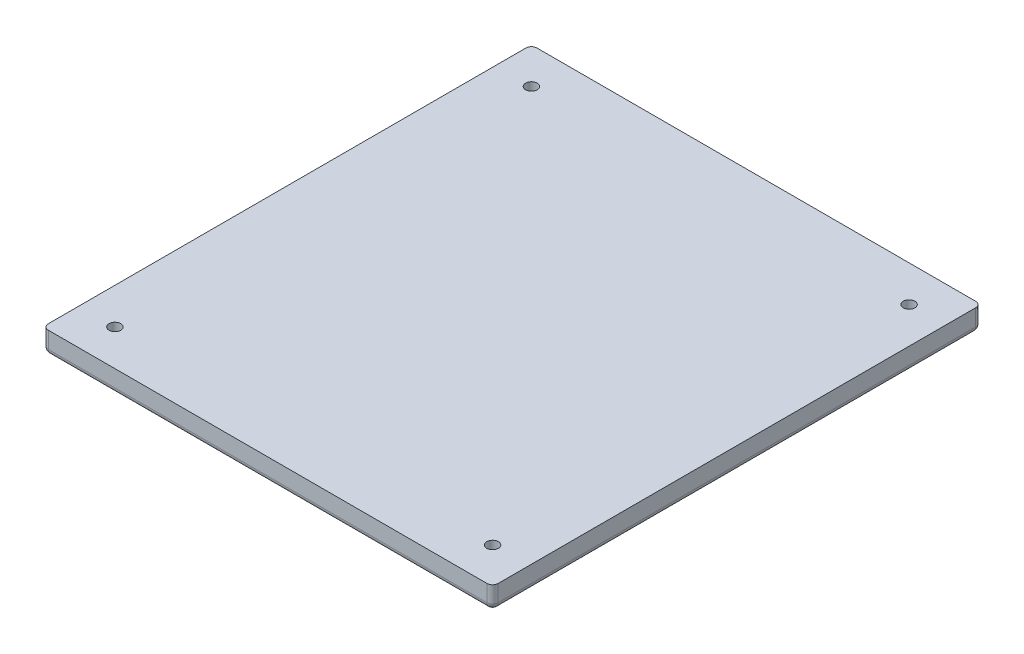
ISO-10303-21;
HEADER;
FILE_DESCRIPTION(('STEP AP214'),'2;1');
FILE_NAME('part.step','',(''),(''),'','','');
FILE_SCHEMA(('AUTOMOTIVE_DESIGN { 1 0 10303 214 1 1 1 1 }'));
ENDSEC;
DATA;
#1=APPLICATION_CONTEXT('core data for automotive mechanical design processes');
#2=APPLICATION_PROTOCOL_DEFINITION('international standard','automotive_design',2000,#1);
#3=PRODUCT_CONTEXT('',#1,'mechanical');
#4=PRODUCT('Part','Part','',(#3));
#5=PRODUCT_RELATED_PRODUCT_CATEGORY('part','',(#4));
#6=PRODUCT_DEFINITION_FORMATION('','',#4);
#7=PRODUCT_DEFINITION_CONTEXT('part definition',#1,'design');
#8=PRODUCT_DEFINITION('design','',#6,#7);
#9=PRODUCT_DEFINITION_SHAPE('','',#8);
#10=(LENGTH_UNIT() NAMED_UNIT(*) SI_UNIT(.MILLI.,.METRE.));
#11=(NAMED_UNIT(*) PLANE_ANGLE_UNIT() SI_UNIT($,.RADIAN.));
#12=(NAMED_UNIT(*) SI_UNIT($,.STERADIAN.) SOLID_ANGLE_UNIT());
#13=UNCERTAINTY_MEASURE_WITH_UNIT(LENGTH_MEASURE(1.E-05),#10,'distance_accuracy_value','');
#14=(GEOMETRIC_REPRESENTATION_CONTEXT(3) GLOBAL_UNCERTAINTY_ASSIGNED_CONTEXT((#13)) GLOBAL_UNIT_ASSIGNED_CONTEXT((#10,
#11,#12)) REPRESENTATION_CONTEXT('',''));
#15=CARTESIAN_POINT('',(0.,0.,0.));
#16=DIRECTION('',(0.,0.,1.));
#17=DIRECTION('',(1.,0.,0.));
#18=AXIS2_PLACEMENT_3D('',#15,#16,#17);
#19=CARTESIAN_POINT('',(0.,4.,0.));
#20=DIRECTION('',(1.,0.,0.));
#21=DIRECTION('',(0.,0.,-1.));
#22=AXIS2_PLACEMENT_3D('',#19,#20,#21);
#23=PLANE('',#22);
#24=DIRECTION('',(0.,0.,1.));
#25=VECTOR('',#24,1.);
#26=CARTESIAN_POINT('',(0.,1.,0.));
#27=LINE('',#26,#25);
#28=CARTESIAN_POINT('',(0.,1.,-87.));
#29=VERTEX_POINT('',#28);
#30=CARTESIAN_POINT('',(0.,1.,-1.));
#31=VERTEX_POINT('',#30);
#32=EDGE_CURVE('E188',#29,#31,#27,.T.);
#33=ORIENTED_EDGE('',*,*,#32,.T.);
#34=DIRECTION('',(0.,-1.,0.));
#35=VECTOR('',#34,1.);
#36=CARTESIAN_POINT('',(0.,4.,-1.));
#37=LINE('',#36,#35);
#38=CARTESIAN_POINT('',(0.,4.,-1.));
#39=VERTEX_POINT('',#38);
#40=EDGE_CURVE('E191',#31,#39,#37,.F.);
#41=ORIENTED_EDGE('',*,*,#40,.T.);
#42=DIRECTION('',(0.,0.,1.));
#43=VECTOR('',#42,1.);
#44=CARTESIAN_POINT('',(0.,4.,0.));
#45=LINE('',#44,#43);
#46=CARTESIAN_POINT('',(0.,4.,-87.));
#47=VERTEX_POINT('',#46);
#48=EDGE_CURVE('E262',#47,#39,#45,.T.);
#49=ORIENTED_EDGE('',*,*,#48,.F.);
#50=DIRECTION('',(0.,-1.,0.));
#51=VECTOR('',#50,1.);
#52=CARTESIAN_POINT('',(0.,4.,-87.));
#53=LINE('',#52,#51);
#54=EDGE_CURVE('E185',#47,#29,#53,.T.);
#55=ORIENTED_EDGE('',*,*,#54,.T.);
#56=EDGE_LOOP('',(#33,#41,#49,#55));
#57=FACE_BOUND('',#56,.T.);
#58=ADVANCED_FACE('F44',(#57),#23,.F.);
#59=CARTESIAN_POINT('',(0.,4.,0.));
#60=DIRECTION('',(0.,0.,-1.));
#61=DIRECTION('',(-1.,0.,0.));
#62=AXIS2_PLACEMENT_3D('',#59,#60,#61);
#63=PLANE('',#62);
#64=DIRECTION('',(1.,0.,0.));
#65=VECTOR('',#64,1.);
#66=CARTESIAN_POINT('',(81.,1.,0.));
#67=LINE('',#66,#65);
#68=CARTESIAN_POINT('',(1.,1.,0.));
#69=VERTEX_POINT('',#68);
#70=CARTESIAN_POINT('',(80.,1.,0.));
#71=VERTEX_POINT('',#70);
#72=EDGE_CURVE('E154',#69,#71,#67,.T.);
#73=ORIENTED_EDGE('',*,*,#72,.T.);
#74=DIRECTION('',(0.,-1.,0.));
#75=VECTOR('',#74,1.);
#76=CARTESIAN_POINT('',(80.,4.,0.));
#77=LINE('',#76,#75);
#78=CARTESIAN_POINT('',(80.,4.,0.));
#79=VERTEX_POINT('',#78);
#80=EDGE_CURVE('E162',#71,#79,#77,.F.);
#81=ORIENTED_EDGE('',*,*,#80,.T.);
#82=DIRECTION('',(1.,0.,0.));
#83=VECTOR('',#82,1.);
#84=CARTESIAN_POINT('',(0.,4.,0.));
#85=LINE('',#84,#83);
#86=CARTESIAN_POINT('',(1.,4.,0.));
#87=VERTEX_POINT('',#86);
#88=EDGE_CURVE('E128',#87,#79,#85,.T.);
#89=ORIENTED_EDGE('',*,*,#88,.F.);
#90=DIRECTION('',(0.,-1.,0.));
#91=VECTOR('',#90,1.);
#92=CARTESIAN_POINT('',(1.,4.,0.));
#93=LINE('',#92,#91);
#94=EDGE_CURVE('E150',#87,#69,#93,.T.);
#95=ORIENTED_EDGE('',*,*,#94,.T.);
#96=EDGE_LOOP('',(#73,#81,#89,#95));
#97=FACE_BOUND('',#96,.T.);
#98=ADVANCED_FACE('F327',(#97),#63,.F.);
#99=CARTESIAN_POINT('',(81.,4.,0.));
#100=DIRECTION('',(-1.,0.,0.));
#101=DIRECTION('',(0.,0.,1.));
#102=AXIS2_PLACEMENT_3D('',#99,#100,#101);
#103=PLANE('',#102);
#104=DIRECTION('',(0.,0.,-1.));
#105=VECTOR('',#104,1.);
#106=CARTESIAN_POINT('',(81.,4.,0.));
#107=LINE('',#106,#105);
#108=CARTESIAN_POINT('',(81.,4.,-1.));
#109=VERTEX_POINT('',#108);
#110=CARTESIAN_POINT('',(81.,4.,-87.));
#111=VERTEX_POINT('',#110);
#112=EDGE_CURVE('E125',#109,#111,#107,.T.);
#113=ORIENTED_EDGE('',*,*,#112,.F.);
#114=DIRECTION('',(0.,-1.,0.));
#115=VECTOR('',#114,1.);
#116=CARTESIAN_POINT('',(81.,4.,-1.));
#117=LINE('',#116,#115);
#118=CARTESIAN_POINT('',(81.,1.,-1.));
#119=VERTEX_POINT('',#118);
#120=EDGE_CURVE('E139',#109,#119,#117,.T.);
#121=ORIENTED_EDGE('',*,*,#120,.T.);
#122=DIRECTION('',(0.,0.,-1.));
#123=VECTOR('',#122,1.);
#124=CARTESIAN_POINT('',(81.,1.,-88.));
#125=LINE('',#124,#123);
#126=CARTESIAN_POINT('',(81.,1.,-87.));
#127=VERTEX_POINT('',#126);
#128=EDGE_CURVE('E156',#119,#127,#125,.T.);
#129=ORIENTED_EDGE('',*,*,#128,.T.);
#130=DIRECTION('',(0.,-1.,0.));
#131=VECTOR('',#130,1.);
#132=CARTESIAN_POINT('',(81.,4.,-87.));
#133=LINE('',#132,#131);
#134=EDGE_CURVE('E141',#127,#111,#133,.F.);
#135=ORIENTED_EDGE('',*,*,#134,.T.);
#136=EDGE_LOOP('',(#113,#121,#129,#135));
#137=FACE_BOUND('',#136,.T.);
#138=ADVANCED_FACE('F138',(#137),#103,.F.);
#139=CARTESIAN_POINT('',(0.,4.,-88.));
#140=DIRECTION('',(0.,0.,1.));
#141=DIRECTION('',(1.,0.,0.));
#142=AXIS2_PLACEMENT_3D('',#139,#140,#141);
#143=PLANE('',#142);
#144=DIRECTION('',(-1.,0.,0.));
#145=VECTOR('',#144,1.);
#146=CARTESIAN_POINT('',(0.,1.,-88.));
#147=LINE('',#146,#145);
#148=CARTESIAN_POINT('',(80.,1.,-88.));
#149=VERTEX_POINT('',#148);
#150=CARTESIAN_POINT('',(1.,1.,-88.));
#151=VERTEX_POINT('',#150);
#152=EDGE_CURVE('E61',#149,#151,#147,.T.);
#153=ORIENTED_EDGE('',*,*,#152,.T.);
#154=DIRECTION('',(0.,-1.,0.));
#155=VECTOR('',#154,1.);
#156=CARTESIAN_POINT('',(1.,4.,-88.));
#157=LINE('',#156,#155);
#158=CARTESIAN_POINT('',(1.,4.,-88.));
#159=VERTEX_POINT('',#158);
#160=EDGE_CURVE('E11',#151,#159,#157,.F.);
#161=ORIENTED_EDGE('',*,*,#160,.T.);
#162=DIRECTION('',(-1.,0.,0.));
#163=VECTOR('',#162,1.);
#164=CARTESIAN_POINT('',(0.,4.,-88.));
#165=LINE('',#164,#163);
#166=CARTESIAN_POINT('',(80.,4.,-88.));
#167=VERTEX_POINT('',#166);
#168=EDGE_CURVE('E143',#167,#159,#165,.T.);
#169=ORIENTED_EDGE('',*,*,#168,.F.);
#170=DIRECTION('',(0.,-1.,0.));
#171=VECTOR('',#170,1.);
#172=CARTESIAN_POINT('',(80.,4.,-88.));
#173=LINE('',#172,#171);
#174=EDGE_CURVE('E54',#167,#149,#173,.T.);
#175=ORIENTED_EDGE('',*,*,#174,.T.);
#176=EDGE_LOOP('',(#153,#161,#169,#175));
#177=FACE_BOUND('',#176,.T.);
#178=ADVANCED_FACE('F363',(#177),#143,.F.);
#179=CARTESIAN_POINT('',(0.,4.,0.));
#180=DIRECTION('',(0.,-1.,0.));
#181=DIRECTION('',(0.,0.,-1.));
#182=AXIS2_PLACEMENT_3D('',#179,#180,#181);
#183=PLANE('',#182);
#184=CARTESIAN_POINT('',(6.5,4.,-6.50000000000001));
#185=DIRECTION('',(0.,1.,0.));
#186=DIRECTION('',(0.,0.,-1.));
#187=AXIS2_PLACEMENT_3D('',#184,#185,#186);
#188=CIRCLE('',#187,1.05);
#189=CARTESIAN_POINT('',(6.5,4.,-7.55));
#190=VERTEX_POINT('',#189);
#191=EDGE_CURVE('E241',#190,#190,#188,.T.);
#192=ORIENTED_EDGE('',*,*,#191,.F.);
#193=EDGE_LOOP('',(#192));
#194=FACE_BOUND('',#193,.T.);
#195=CARTESIAN_POINT('',(74.5,4.,-6.50000000000001));
#196=DIRECTION('',(0.,1.,0.));
#197=DIRECTION('',(0.,0.,1.));
#198=AXIS2_PLACEMENT_3D('',#195,#196,#197);
#199=CIRCLE('',#198,1.04999999999999);
#200=CARTESIAN_POINT('',(74.5,4.,-5.45000000000001));
#201=VERTEX_POINT('',#200);
#202=EDGE_CURVE('E247',#201,#201,#199,.T.);
#203=ORIENTED_EDGE('',*,*,#202,.F.);
#204=EDGE_LOOP('',(#203));
#205=FACE_BOUND('',#204,.T.);
#206=CARTESIAN_POINT('',(74.5,4.,-81.5));
#207=DIRECTION('',(0.,1.,0.));
#208=DIRECTION('',(0.,0.,-1.));
#209=AXIS2_PLACEMENT_3D('',#206,#207,#208);
#210=CIRCLE('',#209,1.04999999999999);
#211=CARTESIAN_POINT('',(74.5,4.,-82.55));
#212=VERTEX_POINT('',#211);
#213=EDGE_CURVE('E253',#212,#212,#210,.T.);
#214=ORIENTED_EDGE('',*,*,#213,.F.);
#215=EDGE_LOOP('',(#214));
#216=FACE_BOUND('',#215,.T.);
#217=CARTESIAN_POINT('',(6.5,4.,-81.5));
#218=DIRECTION('',(0.,1.,0.));
#219=DIRECTION('',(0.,0.,1.));
#220=AXIS2_PLACEMENT_3D('',#217,#218,#219);
#221=CIRCLE('',#220,1.05);
#222=CARTESIAN_POINT('',(6.5,4.,-80.45));
#223=VERTEX_POINT('',#222);
#224=EDGE_CURVE('E257',#223,#223,#221,.T.);
#225=ORIENTED_EDGE('',*,*,#224,.F.);
#226=EDGE_LOOP('',(#225));
#227=FACE_BOUND('',#226,.T.);
#228=ORIENTED_EDGE('',*,*,#88,.T.);
#229=CARTESIAN_POINT('',(80.,4.,-1.));
#230=DIRECTION('',(0.,-1.,0.));
#231=DIRECTION('',(0.,0.,-1.));
#232=AXIS2_PLACEMENT_3D('',#229,#230,#231);
#233=CIRCLE('',#232,1.);
#234=EDGE_CURVE('E122',#79,#109,#233,.F.);
#235=ORIENTED_EDGE('',*,*,#234,.T.);
#236=ORIENTED_EDGE('',*,*,#112,.T.);
#237=CARTESIAN_POINT('',(80.,4.,-87.));
#238=DIRECTION('',(0.,-1.,0.));
#239=DIRECTION('',(0.,0.,-1.));
#240=AXIS2_PLACEMENT_3D('',#237,#238,#239);
#241=CIRCLE('',#240,1.);
#242=EDGE_CURVE('E165',#111,#167,#241,.F.);
#243=ORIENTED_EDGE('',*,*,#242,.T.);
#244=ORIENTED_EDGE('',*,*,#168,.T.);
#245=CARTESIAN_POINT('',(1.,4.,-87.));
#246=DIRECTION('',(0.,-1.,0.));
#247=DIRECTION('',(0.,0.,-1.));
#248=AXIS2_PLACEMENT_3D('',#245,#246,#247);
#249=CIRCLE('',#248,1.);
#250=EDGE_CURVE('E168',#159,#47,#249,.F.);
#251=ORIENTED_EDGE('',*,*,#250,.T.);
#252=ORIENTED_EDGE('',*,*,#48,.T.);
#253=CARTESIAN_POINT('',(1.,4.,-1.));
#254=DIRECTION('',(0.,-1.,0.));
#255=DIRECTION('',(0.,0.,-1.));
#256=AXIS2_PLACEMENT_3D('',#253,#254,#255);
#257=CIRCLE('',#256,1.);
#258=EDGE_CURVE('E134',#39,#87,#257,.F.);
#259=ORIENTED_EDGE('',*,*,#258,.T.);
#260=EDGE_LOOP('',(#228,#235,#236,#243,#244,#251,#252,#259));
#261=FACE_BOUND('',#260,.T.);
#262=ADVANCED_FACE('F124',(#194,#205,#216,#227,#261),#183,.F.);
#263=CARTESIAN_POINT('',(0.,0.,0.));
#264=DIRECTION('',(0.,-1.,0.));
#265=DIRECTION('',(0.,0.,-1.));
#266=AXIS2_PLACEMENT_3D('',#263,#264,#265);
#267=PLANE('',#266);
#268=DIRECTION('',(0.,0.,-1.));
#269=VECTOR('',#268,1.);
#270=CARTESIAN_POINT('',(80.,0.,0.));
#271=LINE('',#270,#269);
#272=CARTESIAN_POINT('',(80.,0.,-87.));
#273=VERTEX_POINT('',#272);
#274=CARTESIAN_POINT('',(80.,0.,-1.));
#275=VERTEX_POINT('',#274);
#276=EDGE_CURVE('E133',#273,#275,#271,.F.);
#277=ORIENTED_EDGE('',*,*,#276,.T.);
#278=DIRECTION('',(1.,0.,0.));
#279=VECTOR('',#278,1.);
#280=CARTESIAN_POINT('',(0.,0.,-1.));
#281=LINE('',#280,#279);
#282=CARTESIAN_POINT('',(1.,0.,-1.));
#283=VERTEX_POINT('',#282);
#284=EDGE_CURVE('E181',#275,#283,#281,.F.);
#285=ORIENTED_EDGE('',*,*,#284,.T.);
#286=DIRECTION('',(0.,0.,1.));
#287=VECTOR('',#286,1.);
#288=CARTESIAN_POINT('',(1.,0.,-88.));
#289=LINE('',#288,#287);
#290=CARTESIAN_POINT('',(1.,0.,-87.));
#291=VERTEX_POINT('',#290);
#292=EDGE_CURVE('E178',#283,#291,#289,.F.);
#293=ORIENTED_EDGE('',*,*,#292,.T.);
#294=DIRECTION('',(-1.,0.,0.));
#295=VECTOR('',#294,1.);
#296=CARTESIAN_POINT('',(81.,0.,-87.));
#297=LINE('',#296,#295);
#298=EDGE_CURVE('E175',#291,#273,#297,.F.);
#299=ORIENTED_EDGE('',*,*,#298,.T.);
#300=EDGE_LOOP('',(#277,#285,#293,#299));
#301=FACE_BOUND('',#300,.T.);
#302=CARTESIAN_POINT('',(6.5,0.,-6.50000000000001));
#303=DIRECTION('',(0.,-1.,0.));
#304=DIRECTION('',(0.,0.,-1.));
#305=AXIS2_PLACEMENT_3D('',#302,#303,#304);
#306=CIRCLE('',#305,1.05);
#307=CARTESIAN_POINT('',(6.5,0.,-7.55));
#308=VERTEX_POINT('',#307);
#309=EDGE_CURVE('E266',#308,#308,#306,.T.);
#310=ORIENTED_EDGE('',*,*,#309,.F.);
#311=EDGE_LOOP('',(#310));
#312=FACE_BOUND('',#311,.T.);
#313=CARTESIAN_POINT('',(74.5,0.,-6.50000000000001));
#314=DIRECTION('',(0.,-1.,0.));
#315=DIRECTION('',(0.,0.,-1.));
#316=AXIS2_PLACEMENT_3D('',#313,#314,#315);
#317=CIRCLE('',#316,1.04999999999999);
#318=CARTESIAN_POINT('',(74.5,0.,-7.55));
#319=VERTEX_POINT('',#318);
#320=EDGE_CURVE('E279',#319,#319,#317,.T.);
#321=ORIENTED_EDGE('',*,*,#320,.F.);
#322=EDGE_LOOP('',(#321));
#323=FACE_BOUND('',#322,.T.);
#324=CARTESIAN_POINT('',(74.5,0.,-81.5));
#325=DIRECTION('',(0.,-1.,0.));
#326=DIRECTION('',(0.,0.,-1.));
#327=AXIS2_PLACEMENT_3D('',#324,#325,#326);
#328=CIRCLE('',#327,1.04999999999999);
#329=CARTESIAN_POINT('',(74.5,0.,-82.55));
#330=VERTEX_POINT('',#329);
#331=EDGE_CURVE('E275',#330,#330,#328,.T.);
#332=ORIENTED_EDGE('',*,*,#331,.F.);
#333=EDGE_LOOP('',(#332));
#334=FACE_BOUND('',#333,.T.);
#335=CARTESIAN_POINT('',(6.5,0.,-81.5));
#336=DIRECTION('',(0.,-1.,0.));
#337=DIRECTION('',(0.,0.,-1.));
#338=AXIS2_PLACEMENT_3D('',#335,#336,#337);
#339=CIRCLE('',#338,1.05);
#340=CARTESIAN_POINT('',(6.5,0.,-82.55));
#341=VERTEX_POINT('',#340);
#342=EDGE_CURVE('E261',#341,#341,#339,.T.);
#343=ORIENTED_EDGE('',*,*,#342,.F.);
#344=EDGE_LOOP('',(#343));
#345=FACE_BOUND('',#344,.T.);
#346=ADVANCED_FACE('F300',(#301,#312,#323,#334,#345),#267,.T.);
#347=CARTESIAN_POINT('',(6.5,-6.,-81.5));
#348=DIRECTION('',(0.,1.,0.));
#349=DIRECTION('',(0.,0.,1.));
#350=AXIS2_PLACEMENT_3D('',#347,#348,#349);
#351=CYLINDRICAL_SURFACE('',#350,1.05);
#352=ORIENTED_EDGE('',*,*,#342,.T.);
#353=EDGE_LOOP('',(#352));
#354=FACE_BOUND('',#353,.T.);
#355=ORIENTED_EDGE('',*,*,#224,.T.);
#356=EDGE_LOOP('',(#355));
#357=FACE_BOUND('',#356,.T.);
#358=ADVANCED_FACE('F374',(#354,#357),#351,.F.);
#359=CARTESIAN_POINT('',(74.5,-6.,-81.5));
#360=DIRECTION('',(0.,1.,0.));
#361=DIRECTION('',(0.,0.,1.));
#362=AXIS2_PLACEMENT_3D('',#359,#360,#361);
#363=CYLINDRICAL_SURFACE('',#362,1.04999999999999);
#364=ORIENTED_EDGE('',*,*,#331,.T.);
#365=EDGE_LOOP('',(#364));
#366=FACE_BOUND('',#365,.T.);
#367=ORIENTED_EDGE('',*,*,#213,.T.);
#368=EDGE_LOOP('',(#367));
#369=FACE_BOUND('',#368,.T.);
#370=ADVANCED_FACE('F378',(#366,#369),#363,.F.);
#371=CARTESIAN_POINT('',(74.5,-6.,-6.50000000000001));
#372=DIRECTION('',(0.,1.,0.));
#373=DIRECTION('',(0.,0.,1.));
#374=AXIS2_PLACEMENT_3D('',#371,#372,#373);
#375=CYLINDRICAL_SURFACE('',#374,1.04999999999999);
#376=ORIENTED_EDGE('',*,*,#320,.T.);
#377=EDGE_LOOP('',(#376));
#378=FACE_BOUND('',#377,.T.);
#379=ORIENTED_EDGE('',*,*,#202,.T.);
#380=EDGE_LOOP('',(#379));
#381=FACE_BOUND('',#380,.T.);
#382=ADVANCED_FACE('F382',(#378,#381),#375,.F.);
#383=CARTESIAN_POINT('',(6.5,-6.,-6.50000000000001));
#384=DIRECTION('',(0.,1.,0.));
#385=DIRECTION('',(0.,0.,1.));
#386=AXIS2_PLACEMENT_3D('',#383,#384,#385);
#387=CYLINDRICAL_SURFACE('',#386,1.05);
#388=ORIENTED_EDGE('',*,*,#309,.T.);
#389=EDGE_LOOP('',(#388));
#390=FACE_BOUND('',#389,.T.);
#391=ORIENTED_EDGE('',*,*,#191,.T.);
#392=EDGE_LOOP('',(#391));
#393=FACE_BOUND('',#392,.T.);
#394=ADVANCED_FACE('F380',(#390,#393),#387,.F.);
#395=CARTESIAN_POINT('',(1.,4.,-87.));
#396=DIRECTION('',(0.,-1.,0.));
#397=DIRECTION('',(0.,0.,-1.));
#398=AXIS2_PLACEMENT_3D('',#395,#396,#397);
#399=CYLINDRICAL_SURFACE('',#398,1.);
#400=CARTESIAN_POINT('',(1.,1.,-87.));
#401=DIRECTION('',(0.,-1.,0.));
#402=DIRECTION('',(0.,0.,-1.));
#403=AXIS2_PLACEMENT_3D('',#400,#401,#402);
#404=CIRCLE('',#403,1.);
#405=EDGE_CURVE('E48',#29,#151,#404,.T.);
#406=ORIENTED_EDGE('',*,*,#405,.F.);
#407=ORIENTED_EDGE('',*,*,#54,.F.);
#408=ORIENTED_EDGE('',*,*,#250,.F.);
#409=ORIENTED_EDGE('',*,*,#160,.F.);
#410=EDGE_LOOP('',(#406,#407,#408,#409));
#411=FACE_BOUND('',#410,.T.);
#412=ADVANCED_FACE('F46',(#411),#399,.T.);
#413=CARTESIAN_POINT('',(1.,1.,-87.));
#414=DIRECTION('',(0.,0.,-1.));
#415=DIRECTION('',(-1.,0.,0.));
#416=AXIS2_PLACEMENT_3D('',#413,#414,#415);
#417=SPHERICAL_SURFACE('',#416,1.);
#418=CARTESIAN_POINT('',(1.,1.,-87.));
#419=DIRECTION('',(0.,0.,-1.));
#420=DIRECTION('',(-1.,0.,0.));
#421=AXIS2_PLACEMENT_3D('',#418,#419,#420);
#422=CIRCLE('',#421,1.);
#423=EDGE_CURVE('E230',#29,#291,#422,.F.);
#424=ORIENTED_EDGE('',*,*,#423,.F.);
#425=ORIENTED_EDGE('',*,*,#405,.T.);
#426=CARTESIAN_POINT('',(1.,1.,-87.));
#427=DIRECTION('',(-1.,0.,0.));
#428=DIRECTION('',(0.,0.,1.));
#429=AXIS2_PLACEMENT_3D('',#426,#427,#428);
#430=CIRCLE('',#429,1.);
#431=EDGE_CURVE('E233',#291,#151,#430,.F.);
#432=ORIENTED_EDGE('',*,*,#431,.F.);
#433=EDGE_LOOP('',(#424,#425,#432));
#434=FACE_BOUND('',#433,.T.);
#435=ADVANCED_FACE('F315',(#434),#417,.T.);
#436=CARTESIAN_POINT('',(80.,4.,-87.));
#437=DIRECTION('',(0.,-1.,0.));
#438=DIRECTION('',(0.,0.,-1.));
#439=AXIS2_PLACEMENT_3D('',#436,#437,#438);
#440=CYLINDRICAL_SURFACE('',#439,1.);
#441=ORIENTED_EDGE('',*,*,#242,.F.);
#442=ORIENTED_EDGE('',*,*,#134,.F.);
#443=CARTESIAN_POINT('',(80.,1.,-87.));
#444=DIRECTION('',(0.,-1.,0.));
#445=DIRECTION('',(0.,0.,-1.));
#446=AXIS2_PLACEMENT_3D('',#443,#444,#445);
#447=CIRCLE('',#446,1.);
#448=EDGE_CURVE('E226',#149,#127,#447,.T.);
#449=ORIENTED_EDGE('',*,*,#448,.F.);
#450=ORIENTED_EDGE('',*,*,#174,.F.);
#451=EDGE_LOOP('',(#441,#442,#449,#450));
#452=FACE_BOUND('',#451,.T.);
#453=ADVANCED_FACE('F291',(#452),#440,.T.);
#454=CARTESIAN_POINT('',(0.,1.,-87.));
#455=DIRECTION('',(1.,0.,0.));
#456=DIRECTION('',(0.,0.,-1.));
#457=AXIS2_PLACEMENT_3D('',#454,#455,#456);
#458=CYLINDRICAL_SURFACE('',#457,1.);
#459=ORIENTED_EDGE('',*,*,#431,.T.);
#460=ORIENTED_EDGE('',*,*,#152,.F.);
#461=CARTESIAN_POINT('',(80.,1.,-87.));
#462=DIRECTION('',(1.,0.,0.));
#463=DIRECTION('',(0.,0.,-1.));
#464=AXIS2_PLACEMENT_3D('',#461,#462,#463);
#465=CIRCLE('',#464,1.);
#466=EDGE_CURVE('E222',#273,#149,#465,.T.);
#467=ORIENTED_EDGE('',*,*,#466,.F.);
#468=ORIENTED_EDGE('',*,*,#298,.F.);
#469=EDGE_LOOP('',(#459,#460,#467,#468));
#470=FACE_BOUND('',#469,.T.);
#471=ADVANCED_FACE('F316',(#470),#458,.T.);
#472=CARTESIAN_POINT('',(1.,1.,0.));
#473=DIRECTION('',(0.,0.,-1.));
#474=DIRECTION('',(-1.,0.,0.));
#475=AXIS2_PLACEMENT_3D('',#472,#473,#474);
#476=CYLINDRICAL_SURFACE('',#475,1.);
#477=ORIENTED_EDGE('',*,*,#423,.T.);
#478=ORIENTED_EDGE('',*,*,#292,.F.);
#479=CARTESIAN_POINT('',(1.,1.,-1.));
#480=DIRECTION('',(0.,0.,1.));
#481=DIRECTION('',(1.,0.,0.));
#482=AXIS2_PLACEMENT_3D('',#479,#480,#481);
#483=CIRCLE('',#482,1.);
#484=EDGE_CURVE('E218',#31,#283,#483,.T.);
#485=ORIENTED_EDGE('',*,*,#484,.F.);
#486=ORIENTED_EDGE('',*,*,#32,.F.);
#487=EDGE_LOOP('',(#477,#478,#485,#486));
#488=FACE_BOUND('',#487,.T.);
#489=ADVANCED_FACE('F314',(#488),#476,.T.);
#490=CARTESIAN_POINT('',(1.,4.,-1.));
#491=DIRECTION('',(0.,-1.,0.));
#492=DIRECTION('',(0.,0.,-1.));
#493=AXIS2_PLACEMENT_3D('',#490,#491,#492);
#494=CYLINDRICAL_SURFACE('',#493,1.);
#495=ORIENTED_EDGE('',*,*,#258,.F.);
#496=ORIENTED_EDGE('',*,*,#40,.F.);
#497=CARTESIAN_POINT('',(1.,1.,-1.));
#498=DIRECTION('',(0.,-1.,0.));
#499=DIRECTION('',(0.,0.,-1.));
#500=AXIS2_PLACEMENT_3D('',#497,#498,#499);
#501=CIRCLE('',#500,1.);
#502=EDGE_CURVE('E214',#69,#31,#501,.T.);
#503=ORIENTED_EDGE('',*,*,#502,.F.);
#504=ORIENTED_EDGE('',*,*,#94,.F.);
#505=EDGE_LOOP('',(#495,#496,#503,#504));
#506=FACE_BOUND('',#505,.T.);
#507=ADVANCED_FACE('F323',(#506),#494,.T.);
#508=CARTESIAN_POINT('',(80.,1.,-87.));
#509=DIRECTION('',(0.,0.,-1.));
#510=DIRECTION('',(-1.,0.,0.));
#511=AXIS2_PLACEMENT_3D('',#508,#509,#510);
#512=SPHERICAL_SURFACE('',#511,1.);
#513=ORIENTED_EDGE('',*,*,#466,.T.);
#514=ORIENTED_EDGE('',*,*,#448,.T.);
#515=CARTESIAN_POINT('',(80.,1.,-87.));
#516=DIRECTION('',(0.,0.,-1.));
#517=DIRECTION('',(-1.,0.,0.));
#518=AXIS2_PLACEMENT_3D('',#515,#516,#517);
#519=CIRCLE('',#518,1.);
#520=EDGE_CURVE('E210',#273,#127,#519,.F.);
#521=ORIENTED_EDGE('',*,*,#520,.F.);
#522=EDGE_LOOP('',(#513,#514,#521));
#523=FACE_BOUND('',#522,.T.);
#524=ADVANCED_FACE('F294',(#523),#512,.T.);
#525=CARTESIAN_POINT('',(1.,1.,-1.));
#526=DIRECTION('',(-1.,0.,0.));
#527=DIRECTION('',(0.,0.,1.));
#528=AXIS2_PLACEMENT_3D('',#525,#526,#527);
#529=SPHERICAL_SURFACE('',#528,1.);
#530=ORIENTED_EDGE('',*,*,#502,.T.);
#531=ORIENTED_EDGE('',*,*,#484,.T.);
#532=CARTESIAN_POINT('',(1.,1.,-1.));
#533=DIRECTION('',(-1.,0.,0.));
#534=DIRECTION('',(0.,0.,1.));
#535=AXIS2_PLACEMENT_3D('',#532,#533,#534);
#536=CIRCLE('',#535,1.);
#537=EDGE_CURVE('E207',#69,#283,#536,.F.);
#538=ORIENTED_EDGE('',*,*,#537,.F.);
#539=EDGE_LOOP('',(#530,#531,#538));
#540=FACE_BOUND('',#539,.T.);
#541=ADVANCED_FACE('F310',(#540),#529,.T.);
#542=CARTESIAN_POINT('',(80.,1.,0.));
#543=DIRECTION('',(0.,0.,1.));
#544=DIRECTION('',(1.,0.,0.));
#545=AXIS2_PLACEMENT_3D('',#542,#543,#544);
#546=CYLINDRICAL_SURFACE('',#545,1.);
#547=ORIENTED_EDGE('',*,*,#520,.T.);
#548=ORIENTED_EDGE('',*,*,#128,.F.);
#549=CARTESIAN_POINT('',(80.,1.,-1.));
#550=DIRECTION('',(0.,0.,1.));
#551=DIRECTION('',(1.,0.,0.));
#552=AXIS2_PLACEMENT_3D('',#549,#550,#551);
#553=CIRCLE('',#552,1.);
#554=EDGE_CURVE('E204',#275,#119,#553,.T.);
#555=ORIENTED_EDGE('',*,*,#554,.F.);
#556=ORIENTED_EDGE('',*,*,#276,.F.);
#557=EDGE_LOOP('',(#547,#548,#555,#556));
#558=FACE_BOUND('',#557,.T.);
#559=ADVANCED_FACE('F297',(#558),#546,.T.);
#560=CARTESIAN_POINT('',(0.,1.,-1.));
#561=DIRECTION('',(-1.,0.,0.));
#562=DIRECTION('',(0.,0.,1.));
#563=AXIS2_PLACEMENT_3D('',#560,#561,#562);
#564=CYLINDRICAL_SURFACE('',#563,1.);
#565=ORIENTED_EDGE('',*,*,#537,.T.);
#566=ORIENTED_EDGE('',*,*,#284,.F.);
#567=CARTESIAN_POINT('',(80.,1.,-1.));
#568=DIRECTION('',(1.,0.,0.));
#569=DIRECTION('',(0.,0.,-1.));
#570=AXIS2_PLACEMENT_3D('',#567,#568,#569);
#571=CIRCLE('',#570,1.);
#572=EDGE_CURVE('E200',#71,#275,#571,.T.);
#573=ORIENTED_EDGE('',*,*,#572,.F.);
#574=ORIENTED_EDGE('',*,*,#72,.F.);
#575=EDGE_LOOP('',(#565,#566,#573,#574));
#576=FACE_BOUND('',#575,.T.);
#577=ADVANCED_FACE('F304',(#576),#564,.T.);
#578=CARTESIAN_POINT('',(80.,1.,-1.));
#579=DIRECTION('',(0.,-1.,0.));
#580=DIRECTION('',(0.,0.,-1.));
#581=AXIS2_PLACEMENT_3D('',#578,#579,#580);
#582=SPHERICAL_SURFACE('',#581,1.);
#583=ORIENTED_EDGE('',*,*,#572,.T.);
#584=ORIENTED_EDGE('',*,*,#554,.T.);
#585=CARTESIAN_POINT('',(80.,1.,-1.));
#586=DIRECTION('',(0.,-1.,0.));
#587=DIRECTION('',(0.,0.,-1.));
#588=AXIS2_PLACEMENT_3D('',#585,#586,#587);
#589=CIRCLE('',#588,1.);
#590=EDGE_CURVE('E147',#71,#119,#589,.F.);
#591=ORIENTED_EDGE('',*,*,#590,.F.);
#592=EDGE_LOOP('',(#583,#584,#591));
#593=FACE_BOUND('',#592,.T.);
#594=ADVANCED_FACE('F340',(#593),#582,.T.);
#595=CARTESIAN_POINT('',(80.,4.,-1.));
#596=DIRECTION('',(0.,-1.,0.));
#597=DIRECTION('',(0.,0.,-1.));
#598=AXIS2_PLACEMENT_3D('',#595,#596,#597);
#599=CYLINDRICAL_SURFACE('',#598,1.);
#600=ORIENTED_EDGE('',*,*,#234,.F.);
#601=ORIENTED_EDGE('',*,*,#80,.F.);
#602=ORIENTED_EDGE('',*,*,#590,.T.);
#603=ORIENTED_EDGE('',*,*,#120,.F.);
#604=EDGE_LOOP('',(#600,#601,#602,#603));
#605=FACE_BOUND('',#604,.T.);
#606=ADVANCED_FACE('F145',(#605),#599,.T.);
#607=CLOSED_SHELL('',(#58,#98,#138,#178,#262,#346,#358,#370,#382,#394,#412,#435,#453,#471,#489,
#507,#524,#541,#559,#577,#594,#606));
#608=MANIFOLD_SOLID_BREP('B2',#607);
#609=ADVANCED_BREP_SHAPE_REPRESENTATION('',(#18,#608),#14);
#610=SHAPE_DEFINITION_REPRESENTATION(#9,#609);
ENDSEC;
END-ISO-10303-21;
